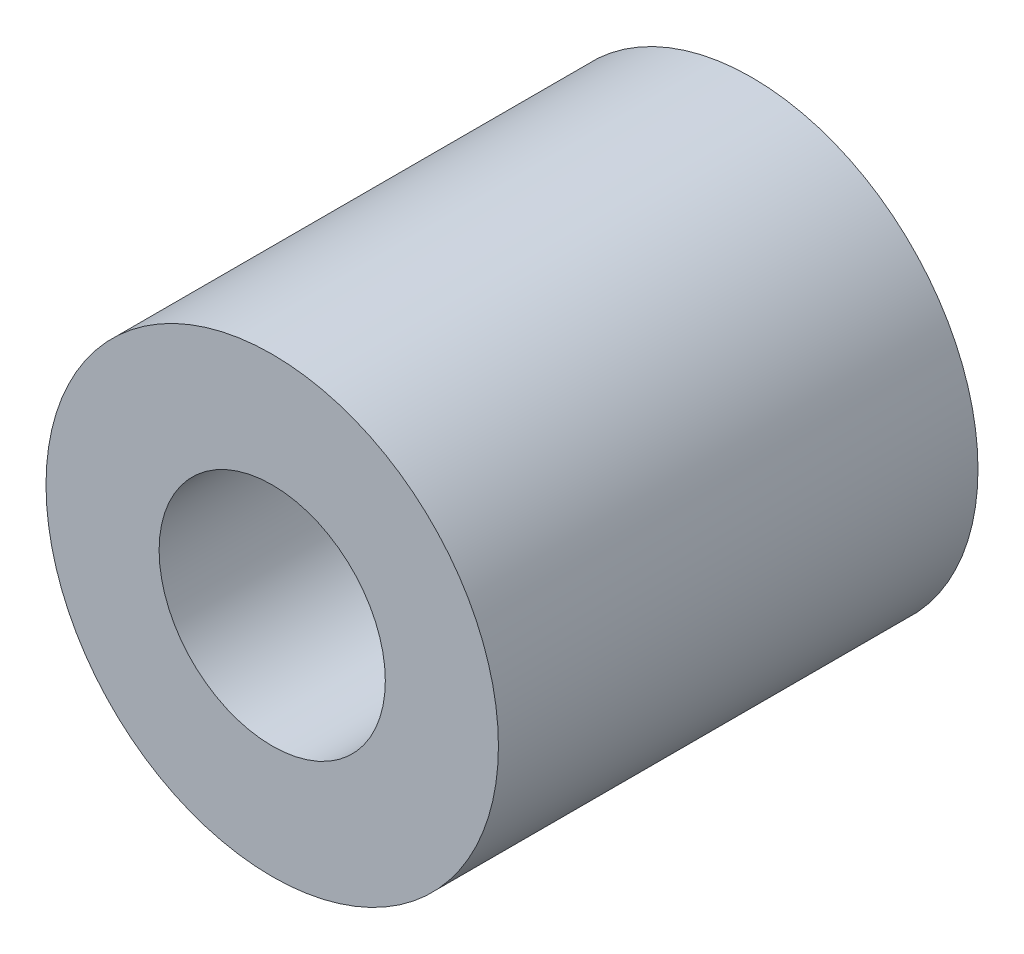
ISO-10303-21;
HEADER;
FILE_DESCRIPTION(('STEP AP214'),'2;1');
FILE_NAME('part.step','',(''),(''),'','','');
FILE_SCHEMA(('AUTOMOTIVE_DESIGN { 1 0 10303 214 1 1 1 1 }'));
ENDSEC;
DATA;
#1=APPLICATION_CONTEXT('core data for automotive mechanical design processes');
#2=APPLICATION_PROTOCOL_DEFINITION('international standard','automotive_design',2000,#1);
#3=PRODUCT_CONTEXT('',#1,'mechanical');
#4=PRODUCT('Part','Part','',(#3));
#5=PRODUCT_RELATED_PRODUCT_CATEGORY('part','',(#4));
#6=PRODUCT_DEFINITION_FORMATION('','',#4);
#7=PRODUCT_DEFINITION_CONTEXT('part definition',#1,'design');
#8=PRODUCT_DEFINITION('design','',#6,#7);
#9=PRODUCT_DEFINITION_SHAPE('','',#8);
#10=(LENGTH_UNIT() NAMED_UNIT(*) SI_UNIT(.MILLI.,.METRE.));
#11=(NAMED_UNIT(*) PLANE_ANGLE_UNIT() SI_UNIT($,.RADIAN.));
#12=(NAMED_UNIT(*) SI_UNIT($,.STERADIAN.) SOLID_ANGLE_UNIT());
#13=UNCERTAINTY_MEASURE_WITH_UNIT(LENGTH_MEASURE(1.E-05),#10,'distance_accuracy_value','');
#14=(GEOMETRIC_REPRESENTATION_CONTEXT(3) GLOBAL_UNCERTAINTY_ASSIGNED_CONTEXT((#13)) GLOBAL_UNIT_ASSIGNED_CONTEXT((#10,
#11,#12)) REPRESENTATION_CONTEXT('',''));
#15=CARTESIAN_POINT('',(0.,0.,0.));
#16=DIRECTION('',(0.,0.,1.));
#17=DIRECTION('',(1.,0.,0.));
#18=AXIS2_PLACEMENT_3D('',#15,#16,#17);
#19=CARTESIAN_POINT('',(0.,0.,10.6));
#20=DIRECTION('',(0.,0.,-1.));
#21=DIRECTION('',(-1.,0.,0.));
#22=AXIS2_PLACEMENT_3D('',#19,#20,#21);
#23=CYLINDRICAL_SURFACE('',#22,5.);
#24=CARTESIAN_POINT('',(0.,0.,10.6));
#25=DIRECTION('',(0.,0.,1.));
#26=DIRECTION('',(1.,0.,0.));
#27=AXIS2_PLACEMENT_3D('',#24,#25,#26);
#28=CIRCLE('',#27,5.);
#29=CARTESIAN_POINT('',(5.,0.,10.6));
#30=VERTEX_POINT('',#29);
#31=EDGE_CURVE('E10',#30,#30,#28,.T.);
#32=ORIENTED_EDGE('',*,*,#31,.F.);
#33=EDGE_LOOP('',(#32));
#34=FACE_BOUND('',#33,.T.);
#35=CARTESIAN_POINT('',(0.,0.,0.));
#36=DIRECTION('',(0.,0.,1.));
#37=DIRECTION('',(1.,0.,0.));
#38=AXIS2_PLACEMENT_3D('',#35,#36,#37);
#39=CIRCLE('',#38,5.);
#40=CARTESIAN_POINT('',(5.,0.,0.));
#41=VERTEX_POINT('',#40);
#42=EDGE_CURVE('E36',#41,#41,#39,.T.);
#43=ORIENTED_EDGE('',*,*,#42,.T.);
#44=EDGE_LOOP('',(#43));
#45=FACE_BOUND('',#44,.T.);
#46=ADVANCED_FACE('F33',(#34,#45),#23,.T.);
#47=CARTESIAN_POINT('',(0.,0.,10.6));
#48=DIRECTION('',(0.,0.,1.));
#49=DIRECTION('',(1.,0.,0.));
#50=AXIS2_PLACEMENT_3D('',#47,#48,#49);
#51=PLANE('',#50);
#52=CARTESIAN_POINT('',(0.,0.,10.6));
#53=DIRECTION('',(0.,0.,1.));
#54=DIRECTION('',(1.,0.,0.));
#55=AXIS2_PLACEMENT_3D('',#52,#53,#54);
#56=CIRCLE('',#55,2.5);
#57=CARTESIAN_POINT('',(2.5,0.,10.6));
#58=VERTEX_POINT('',#57);
#59=EDGE_CURVE('E47',#58,#58,#56,.T.);
#60=ORIENTED_EDGE('',*,*,#59,.F.);
#61=EDGE_LOOP('',(#60));
#62=FACE_BOUND('',#61,.T.);
#63=ORIENTED_EDGE('',*,*,#31,.T.);
#64=EDGE_LOOP('',(#63));
#65=FACE_BOUND('',#64,.T.);
#66=ADVANCED_FACE('F53',(#62,#65),#51,.T.);
#67=CARTESIAN_POINT('',(0.,0.,0.));
#68=DIRECTION('',(0.,0.,1.));
#69=DIRECTION('',(1.,0.,0.));
#70=AXIS2_PLACEMENT_3D('',#67,#68,#69);
#71=PLANE('',#70);
#72=CARTESIAN_POINT('',(0.,0.,0.));
#73=DIRECTION('',(0.,0.,1.));
#74=DIRECTION('',(1.,0.,0.));
#75=AXIS2_PLACEMENT_3D('',#72,#73,#74);
#76=CIRCLE('',#75,2.5);
#77=CARTESIAN_POINT('',(2.5,0.,0.));
#78=VERTEX_POINT('',#77);
#79=EDGE_CURVE('E43',#78,#78,#76,.T.);
#80=ORIENTED_EDGE('',*,*,#79,.T.);
#81=EDGE_LOOP('',(#80));
#82=FACE_BOUND('',#81,.T.);
#83=ORIENTED_EDGE('',*,*,#42,.F.);
#84=EDGE_LOOP('',(#83));
#85=FACE_BOUND('',#84,.T.);
#86=ADVANCED_FACE('F55',(#82,#85),#71,.F.);
#87=CARTESIAN_POINT('',(0.,0.,10.6));
#88=DIRECTION('',(0.,0.,1.));
#89=DIRECTION('',(1.,0.,0.));
#90=AXIS2_PLACEMENT_3D('',#87,#88,#89);
#91=CYLINDRICAL_SURFACE('',#90,2.5);
#92=ORIENTED_EDGE('',*,*,#79,.F.);
#93=EDGE_LOOP('',(#92));
#94=FACE_BOUND('',#93,.T.);
#95=ORIENTED_EDGE('',*,*,#59,.T.);
#96=EDGE_LOOP('',(#95));
#97=FACE_BOUND('',#96,.T.);
#98=ADVANCED_FACE('F51',(#94,#97),#91,.F.);
#99=CLOSED_SHELL('',(#46,#66,#86,#98));
#100=MANIFOLD_SOLID_BREP('B2',#99);
#101=ADVANCED_BREP_SHAPE_REPRESENTATION('',(#18,#100),#14);
#102=SHAPE_DEFINITION_REPRESENTATION(#9,#101);
ENDSEC;
END-ISO-10303-21;
